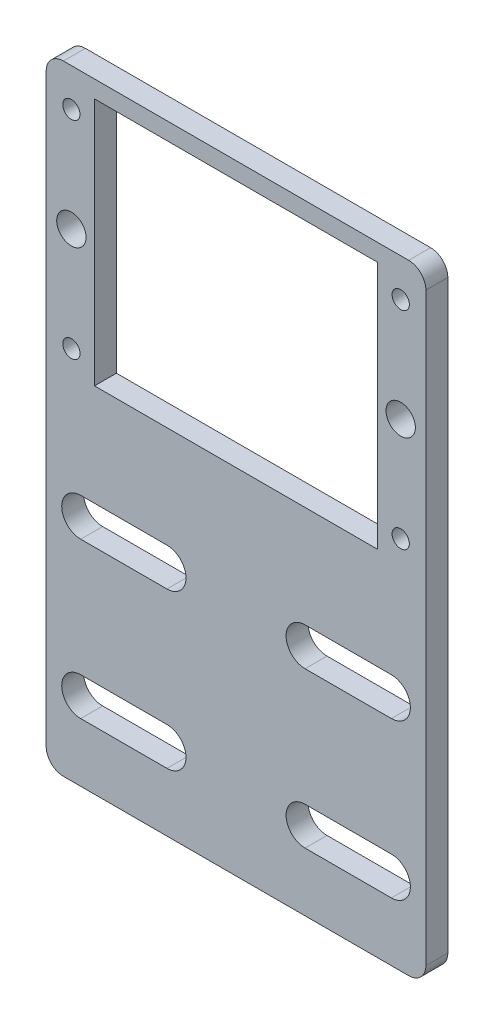
ISO-10303-21;
HEADER;
FILE_DESCRIPTION(('STEP AP214'),'2;1');
FILE_NAME('part.step','',(''),(''),'','','');
FILE_SCHEMA(('AUTOMOTIVE_DESIGN { 1 0 10303 214 1 1 1 1 }'));
ENDSEC;
DATA;
#1=APPLICATION_CONTEXT('core data for automotive mechanical design processes');
#2=APPLICATION_PROTOCOL_DEFINITION('international standard','automotive_design',2000,#1);
#3=PRODUCT_CONTEXT('',#1,'mechanical');
#4=PRODUCT('Part','Part','',(#3));
#5=PRODUCT_RELATED_PRODUCT_CATEGORY('part','',(#4));
#6=PRODUCT_DEFINITION_FORMATION('','',#4);
#7=PRODUCT_DEFINITION_CONTEXT('part definition',#1,'design');
#8=PRODUCT_DEFINITION('design','',#6,#7);
#9=PRODUCT_DEFINITION_SHAPE('','',#8);
#10=(LENGTH_UNIT() NAMED_UNIT(*) SI_UNIT(.MILLI.,.METRE.));
#11=(NAMED_UNIT(*) PLANE_ANGLE_UNIT() SI_UNIT($,.RADIAN.));
#12=(NAMED_UNIT(*) SI_UNIT($,.STERADIAN.) SOLID_ANGLE_UNIT());
#13=UNCERTAINTY_MEASURE_WITH_UNIT(LENGTH_MEASURE(1.E-05),#10,'distance_accuracy_value','');
#14=(GEOMETRIC_REPRESENTATION_CONTEXT(3) GLOBAL_UNCERTAINTY_ASSIGNED_CONTEXT((#13)) GLOBAL_UNIT_ASSIGNED_CONTEXT((#10,
#11,#12)) REPRESENTATION_CONTEXT('',''));
#15=CARTESIAN_POINT('',(0.,0.,0.));
#16=DIRECTION('',(0.,0.,1.));
#17=DIRECTION('',(1.,0.,0.));
#18=AXIS2_PLACEMENT_3D('',#15,#16,#17);
#19=CARTESIAN_POINT('',(0.,0.,6.35));
#20=DIRECTION('',(1.,0.,0.));
#21=DIRECTION('',(0.,0.,-1.));
#22=AXIS2_PLACEMENT_3D('',#19,#20,#21);
#23=PLANE('',#22);
#24=DIRECTION('',(0.,-1.,0.));
#25=VECTOR('',#24,1.);
#26=CARTESIAN_POINT('',(0.,0.,6.35));
#27=LINE('',#26,#25);
#28=CARTESIAN_POINT('',(0.,77.,6.35));
#29=VERTEX_POINT('',#28);
#30=CARTESIAN_POINT('',(0.,-92.464272110841,6.35));
#31=VERTEX_POINT('',#30);
#32=EDGE_CURVE('E397',#29,#31,#27,.T.);
#33=ORIENTED_EDGE('',*,*,#32,.F.);
#34=DIRECTION('',(0.,0.,-1.));
#35=VECTOR('',#34,1.);
#36=CARTESIAN_POINT('',(0.,77.,6.35));
#37=LINE('',#36,#35);
#38=CARTESIAN_POINT('',(0.,77.,0.));
#39=VERTEX_POINT('',#38);
#40=EDGE_CURVE('E439',#29,#39,#37,.T.);
#41=ORIENTED_EDGE('',*,*,#40,.T.);
#42=DIRECTION('',(0.,-1.,0.));
#43=VECTOR('',#42,1.);
#44=CARTESIAN_POINT('',(0.,0.,0.));
#45=LINE('',#44,#43);
#46=CARTESIAN_POINT('',(0.,-92.464272110841,0.));
#47=VERTEX_POINT('',#46);
#48=EDGE_CURVE('E396',#39,#47,#45,.T.);
#49=ORIENTED_EDGE('',*,*,#48,.T.);
#50=DIRECTION('',(0.,0.,1.));
#51=VECTOR('',#50,1.);
#52=CARTESIAN_POINT('',(0.,-92.464272110841,6.35));
#53=LINE('',#52,#51);
#54=EDGE_CURVE('E436',#47,#31,#53,.T.);
#55=ORIENTED_EDGE('',*,*,#54,.T.);
#56=EDGE_LOOP('',(#33,#41,#49,#55));
#57=FACE_BOUND('',#56,.T.);
#58=ADVANCED_FACE('F34',(#57),#23,.F.);
#59=CARTESIAN_POINT('',(110.,0.,6.35));
#60=DIRECTION('',(-1.,0.,0.));
#61=DIRECTION('',(0.,0.,1.));
#62=AXIS2_PLACEMENT_3D('',#59,#60,#61);
#63=PLANE('',#62);
#64=DIRECTION('',(0.,1.,0.));
#65=VECTOR('',#64,1.);
#66=CARTESIAN_POINT('',(110.,0.,0.));
#67=LINE('',#66,#65);
#68=CARTESIAN_POINT('',(110.,-92.464272110841,0.));
#69=VERTEX_POINT('',#68);
#70=CARTESIAN_POINT('',(110.,77.,0.));
#71=VERTEX_POINT('',#70);
#72=EDGE_CURVE('E409',#69,#71,#67,.T.);
#73=ORIENTED_EDGE('',*,*,#72,.T.);
#74=DIRECTION('',(0.,0.,-1.));
#75=VECTOR('',#74,1.);
#76=CARTESIAN_POINT('',(110.,77.,6.35));
#77=LINE('',#76,#75);
#78=CARTESIAN_POINT('',(110.,77.,6.35));
#79=VERTEX_POINT('',#78);
#80=EDGE_CURVE('E428',#71,#79,#77,.F.);
#81=ORIENTED_EDGE('',*,*,#80,.T.);
#82=DIRECTION('',(0.,1.,0.));
#83=VECTOR('',#82,1.);
#84=CARTESIAN_POINT('',(110.,0.,6.35));
#85=LINE('',#84,#83);
#86=CARTESIAN_POINT('',(110.,-92.464272110841,6.35));
#87=VERTEX_POINT('',#86);
#88=EDGE_CURVE('E399',#87,#79,#85,.T.);
#89=ORIENTED_EDGE('',*,*,#88,.F.);
#90=DIRECTION('',(0.,0.,1.));
#91=VECTOR('',#90,1.);
#92=CARTESIAN_POINT('',(110.,-92.464272110841,0.));
#93=LINE('',#92,#91);
#94=EDGE_CURVE('E426',#87,#69,#93,.F.);
#95=ORIENTED_EDGE('',*,*,#94,.T.);
#96=EDGE_LOOP('',(#73,#81,#89,#95));
#97=FACE_BOUND('',#96,.T.);
#98=ADVANCED_FACE('F450',(#97),#63,.F.);
#99=CARTESIAN_POINT('',(0.,82.,6.35));
#100=DIRECTION('',(0.,-1.,0.));
#101=DIRECTION('',(0.,0.,-1.));
#102=AXIS2_PLACEMENT_3D('',#99,#100,#101);
#103=PLANE('',#102);
#104=DIRECTION('',(-1.,0.,0.));
#105=VECTOR('',#104,1.);
#106=CARTESIAN_POINT('',(0.,82.,6.35));
#107=LINE('',#106,#105);
#108=CARTESIAN_POINT('',(105.,82.,6.35));
#109=VERTEX_POINT('',#108);
#110=CARTESIAN_POINT('',(5.,82.,6.35));
#111=VERTEX_POINT('',#110);
#112=EDGE_CURVE('E403',#109,#111,#107,.T.);
#113=ORIENTED_EDGE('',*,*,#112,.F.);
#114=DIRECTION('',(0.,0.,-1.));
#115=VECTOR('',#114,1.);
#116=CARTESIAN_POINT('',(105.,82.,6.35));
#117=LINE('',#116,#115);
#118=CARTESIAN_POINT('',(105.,82.,0.));
#119=VERTEX_POINT('',#118);
#120=EDGE_CURVE('E415',#109,#119,#117,.T.);
#121=ORIENTED_EDGE('',*,*,#120,.T.);
#122=DIRECTION('',(-1.,0.,0.));
#123=VECTOR('',#122,1.);
#124=CARTESIAN_POINT('',(0.,82.,0.));
#125=LINE('',#124,#123);
#126=CARTESIAN_POINT('',(5.,82.,0.));
#127=VERTEX_POINT('',#126);
#128=EDGE_CURVE('E400',#119,#127,#125,.T.);
#129=ORIENTED_EDGE('',*,*,#128,.T.);
#130=DIRECTION('',(0.,0.,-1.));
#131=VECTOR('',#130,1.);
#132=CARTESIAN_POINT('',(5.,82.,6.35));
#133=LINE('',#132,#131);
#134=EDGE_CURVE('E406',#127,#111,#133,.F.);
#135=ORIENTED_EDGE('',*,*,#134,.T.);
#136=EDGE_LOOP('',(#113,#121,#129,#135));
#137=FACE_BOUND('',#136,.T.);
#138=ADVANCED_FACE('F462',(#137),#103,.F.);
#139=CARTESIAN_POINT('',(0.,0.,6.35));
#140=DIRECTION('',(0.,0.,-1.));
#141=DIRECTION('',(-1.,0.,0.));
#142=AXIS2_PLACEMENT_3D('',#139,#140,#141);
#143=PLANE('',#142);
#144=CARTESIAN_POINT('',(7.29880000000002,70.9974,6.35));
#145=DIRECTION('',(0.,0.,1.));
#146=DIRECTION('',(-1.,0.,0.));
#147=AXIS2_PLACEMENT_3D('',#144,#145,#146);
#148=CIRCLE('',#147,2.5019);
#149=CARTESIAN_POINT('',(4.79690000000002,70.9974,6.35));
#150=VERTEX_POINT('',#149);
#151=EDGE_CURVE('E796',#150,#150,#148,.T.);
#152=ORIENTED_EDGE('',*,*,#151,.F.);
#153=EDGE_LOOP('',(#152));
#154=FACE_BOUND('',#153,.T.);
#155=CARTESIAN_POINT('',(102.7012,70.9974,6.35));
#156=DIRECTION('',(0.,0.,1.));
#157=DIRECTION('',(1.,0.,0.));
#158=AXIS2_PLACEMENT_3D('',#155,#156,#157);
#159=CIRCLE('',#158,2.50189999999999);
#160=CARTESIAN_POINT('',(105.2031,70.9974,6.35));
#161=VERTEX_POINT('',#160);
#162=EDGE_CURVE('E801',#161,#161,#159,.T.);
#163=ORIENTED_EDGE('',*,*,#162,.F.);
#164=EDGE_LOOP('',(#163));
#165=FACE_BOUND('',#164,.T.);
#166=CARTESIAN_POINT('',(102.7012,11.0026,6.35));
#167=DIRECTION('',(0.,0.,1.));
#168=DIRECTION('',(-1.,0.,0.));
#169=AXIS2_PLACEMENT_3D('',#166,#167,#168);
#170=CIRCLE('',#169,2.50190000000001);
#171=CARTESIAN_POINT('',(100.1993,11.0026,6.35));
#172=VERTEX_POINT('',#171);
#173=EDGE_CURVE('E812',#172,#172,#170,.T.);
#174=ORIENTED_EDGE('',*,*,#173,.F.);
#175=EDGE_LOOP('',(#174));
#176=FACE_BOUND('',#175,.T.);
#177=CARTESIAN_POINT('',(7.29880000000002,41.,6.35));
#178=DIRECTION('',(0.,0.,1.));
#179=DIRECTION('',(1.,0.,0.));
#180=AXIS2_PLACEMENT_3D('',#177,#178,#179);
#181=CIRCLE('',#180,4.25);
#182=CARTESIAN_POINT('',(11.5488,41.,6.35));
#183=VERTEX_POINT('',#182);
#184=EDGE_CURVE('E818',#183,#183,#181,.T.);
#185=ORIENTED_EDGE('',*,*,#184,.F.);
#186=EDGE_LOOP('',(#185));
#187=FACE_BOUND('',#186,.T.);
#188=CARTESIAN_POINT('',(102.7012,41.,6.35));
#189=DIRECTION('',(0.,0.,1.));
#190=DIRECTION('',(-1.,0.,0.));
#191=AXIS2_PLACEMENT_3D('',#188,#189,#190);
#192=CIRCLE('',#191,4.24999999999999);
#193=CARTESIAN_POINT('',(98.4512,41.,6.35));
#194=VERTEX_POINT('',#193);
#195=EDGE_CURVE('E824',#194,#194,#192,.T.);
#196=ORIENTED_EDGE('',*,*,#195,.F.);
#197=EDGE_LOOP('',(#196));
#198=FACE_BOUND('',#197,.T.);
#199=CARTESIAN_POINT('',(7.29880000000002,11.0026,6.35));
#200=DIRECTION('',(0.,0.,1.));
#201=DIRECTION('',(1.,0.,0.));
#202=AXIS2_PLACEMENT_3D('',#199,#200,#201);
#203=CIRCLE('',#202,2.5019);
#204=CARTESIAN_POINT('',(9.80070000000002,11.0026,6.35));
#205=VERTEX_POINT('',#204);
#206=EDGE_CURVE('E300',#205,#205,#203,.T.);
#207=ORIENTED_EDGE('',*,*,#206,.F.);
#208=EDGE_LOOP('',(#207));
#209=FACE_BOUND('',#208,.T.);
#210=DIRECTION('',(1.,0.,0.));
#211=VECTOR('',#210,1.);
#212=CARTESIAN_POINT('',(10.,-35.464272110841,6.35));
#213=LINE('',#212,#211);
#214=CARTESIAN_POINT('',(10.,-35.464272110841,6.35));
#215=VERTEX_POINT('',#214);
#216=CARTESIAN_POINT('',(35.,-35.464272110841,6.35));
#217=VERTEX_POINT('',#216);
#218=EDGE_CURVE('E308',#215,#217,#213,.T.);
#219=ORIENTED_EDGE('',*,*,#218,.F.);
#220=CARTESIAN_POINT('',(10.,-29.964272110841,6.35));
#221=DIRECTION('',(0.,0.,1.));
#222=DIRECTION('',(-1.,0.,0.));
#223=AXIS2_PLACEMENT_3D('',#220,#221,#222);
#224=CIRCLE('',#223,5.5);
#225=CARTESIAN_POINT('',(10.,-24.464272110841,6.35));
#226=VERTEX_POINT('',#225);
#227=EDGE_CURVE('E306',#226,#215,#224,.T.);
#228=ORIENTED_EDGE('',*,*,#227,.F.);
#229=DIRECTION('',(-1.,0.,0.));
#230=VECTOR('',#229,1.);
#231=CARTESIAN_POINT('',(10.,-24.464272110841,6.35));
#232=LINE('',#231,#230);
#233=CARTESIAN_POINT('',(35.,-24.464272110841,6.35));
#234=VERTEX_POINT('',#233);
#235=EDGE_CURVE('E314',#234,#226,#232,.T.);
#236=ORIENTED_EDGE('',*,*,#235,.F.);
#237=CARTESIAN_POINT('',(35.,-29.964272110841,6.35));
#238=DIRECTION('',(0.,0.,1.));
#239=DIRECTION('',(-1.,0.,0.));
#240=AXIS2_PLACEMENT_3D('',#237,#238,#239);
#241=CIRCLE('',#240,5.50000000000001);
#242=EDGE_CURVE('E311',#217,#234,#241,.T.);
#243=ORIENTED_EDGE('',*,*,#242,.F.);
#244=EDGE_LOOP('',(#219,#228,#236,#243));
#245=FACE_BOUND('',#244,.T.);
#246=DIRECTION('',(-1.,0.,0.));
#247=VECTOR('',#246,1.);
#248=CARTESIAN_POINT('',(100.,-24.464272110841,6.35));
#249=LINE('',#248,#247);
#250=CARTESIAN_POINT('',(100.,-24.464272110841,6.35));
#251=VERTEX_POINT('',#250);
#252=CARTESIAN_POINT('',(75.,-24.464272110841,6.35));
#253=VERTEX_POINT('',#252);
#254=EDGE_CURVE('E275',#251,#253,#249,.T.);
#255=ORIENTED_EDGE('',*,*,#254,.F.);
#256=CARTESIAN_POINT('',(100.,-29.964272110841,6.35));
#257=DIRECTION('',(0.,0.,1.));
#258=DIRECTION('',(1.,0.,0.));
#259=AXIS2_PLACEMENT_3D('',#256,#257,#258);
#260=CIRCLE('',#259,5.5);
#261=CARTESIAN_POINT('',(100.,-35.464272110841,6.35));
#262=VERTEX_POINT('',#261);
#263=EDGE_CURVE('E273',#262,#251,#260,.T.);
#264=ORIENTED_EDGE('',*,*,#263,.F.);
#265=DIRECTION('',(1.,0.,0.));
#266=VECTOR('',#265,1.);
#267=CARTESIAN_POINT('',(100.,-35.464272110841,6.35));
#268=LINE('',#267,#266);
#269=CARTESIAN_POINT('',(75.,-35.464272110841,6.35));
#270=VERTEX_POINT('',#269);
#271=EDGE_CURVE('E281',#270,#262,#268,.T.);
#272=ORIENTED_EDGE('',*,*,#271,.F.);
#273=CARTESIAN_POINT('',(75.,-29.964272110841,6.35));
#274=DIRECTION('',(0.,0.,1.));
#275=DIRECTION('',(1.,0.,0.));
#276=AXIS2_PLACEMENT_3D('',#273,#274,#275);
#277=CIRCLE('',#276,5.50000000000001);
#278=EDGE_CURVE('E278',#253,#270,#277,.T.);
#279=ORIENTED_EDGE('',*,*,#278,.F.);
#280=EDGE_LOOP('',(#255,#264,#272,#279));
#281=FACE_BOUND('',#280,.T.);
#282=DIRECTION('',(-1.,0.,0.));
#283=VECTOR('',#282,1.);
#284=CARTESIAN_POINT('',(100.,-69.464272110841,6.35));
#285=LINE('',#284,#283);
#286=CARTESIAN_POINT('',(100.,-69.464272110841,6.35));
#287=VERTEX_POINT('',#286);
#288=CARTESIAN_POINT('',(75.,-69.464272110841,6.35));
#289=VERTEX_POINT('',#288);
#290=EDGE_CURVE('E247',#287,#289,#285,.T.);
#291=ORIENTED_EDGE('',*,*,#290,.F.);
#292=CARTESIAN_POINT('',(100.,-74.964272110841,6.35));
#293=DIRECTION('',(0.,0.,1.));
#294=DIRECTION('',(-1.,0.,0.));
#295=AXIS2_PLACEMENT_3D('',#292,#293,#294);
#296=CIRCLE('',#295,5.50000000000001);
#297=CARTESIAN_POINT('',(100.,-80.464272110841,6.35));
#298=VERTEX_POINT('',#297);
#299=EDGE_CURVE('E239',#298,#287,#296,.T.);
#300=ORIENTED_EDGE('',*,*,#299,.F.);
#301=DIRECTION('',(1.,0.,0.));
#302=VECTOR('',#301,1.);
#303=CARTESIAN_POINT('',(100.,-80.464272110841,6.35));
#304=LINE('',#303,#302);
#305=CARTESIAN_POINT('',(75.,-80.464272110841,6.35));
#306=VERTEX_POINT('',#305);
#307=EDGE_CURVE('E240',#306,#298,#304,.T.);
#308=ORIENTED_EDGE('',*,*,#307,.F.);
#309=CARTESIAN_POINT('',(75.,-74.964272110841,6.35));
#310=DIRECTION('',(0.,0.,1.));
#311=DIRECTION('',(-1.,0.,0.));
#312=AXIS2_PLACEMENT_3D('',#309,#310,#311);
#313=CIRCLE('',#312,5.50000000000001);
#314=EDGE_CURVE('E254',#289,#306,#313,.T.);
#315=ORIENTED_EDGE('',*,*,#314,.F.);
#316=EDGE_LOOP('',(#291,#300,#308,#315));
#317=FACE_BOUND('',#316,.T.);
#318=DIRECTION('',(1.,0.,0.));
#319=VECTOR('',#318,1.);
#320=CARTESIAN_POINT('',(10.,-80.464272110841,6.35));
#321=LINE('',#320,#319);
#322=CARTESIAN_POINT('',(10.,-80.464272110841,6.35));
#323=VERTEX_POINT('',#322);
#324=CARTESIAN_POINT('',(35.,-80.464272110841,6.35));
#325=VERTEX_POINT('',#324);
#326=EDGE_CURVE('E338',#323,#325,#321,.T.);
#327=ORIENTED_EDGE('',*,*,#326,.F.);
#328=CARTESIAN_POINT('',(10.,-74.964272110841,6.35));
#329=DIRECTION('',(0.,0.,1.));
#330=DIRECTION('',(1.,0.,0.));
#331=AXIS2_PLACEMENT_3D('',#328,#329,#330);
#332=CIRCLE('',#331,5.50000000000001);
#333=CARTESIAN_POINT('',(10.,-69.464272110841,6.35));
#334=VERTEX_POINT('',#333);
#335=EDGE_CURVE('E336',#334,#323,#332,.T.);
#336=ORIENTED_EDGE('',*,*,#335,.F.);
#337=DIRECTION('',(-1.,0.,0.));
#338=VECTOR('',#337,1.);
#339=CARTESIAN_POINT('',(10.,-69.464272110841,6.35));
#340=LINE('',#339,#338);
#341=CARTESIAN_POINT('',(35.,-69.464272110841,6.35));
#342=VERTEX_POINT('',#341);
#343=EDGE_CURVE('E344',#342,#334,#340,.T.);
#344=ORIENTED_EDGE('',*,*,#343,.F.);
#345=CARTESIAN_POINT('',(35.,-74.964272110841,6.35));
#346=DIRECTION('',(0.,0.,1.));
#347=DIRECTION('',(1.,0.,0.));
#348=AXIS2_PLACEMENT_3D('',#345,#346,#347);
#349=CIRCLE('',#348,5.50000000000001);
#350=EDGE_CURVE('E341',#325,#342,#349,.T.);
#351=ORIENTED_EDGE('',*,*,#350,.F.);
#352=EDGE_LOOP('',(#327,#336,#344,#351));
#353=FACE_BOUND('',#352,.T.);
#354=DIRECTION('',(-1.,0.,0.));
#355=VECTOR('',#354,1.);
#356=CARTESIAN_POINT('',(14.,77.,6.35));
#357=LINE('',#356,#355);
#358=CARTESIAN_POINT('',(96.,77.,6.35));
#359=VERTEX_POINT('',#358);
#360=CARTESIAN_POINT('',(14.,77.,6.35));
#361=VERTEX_POINT('',#360);
#362=EDGE_CURVE('E375',#359,#361,#357,.T.);
#363=ORIENTED_EDGE('',*,*,#362,.F.);
#364=DIRECTION('',(0.,1.,0.));
#365=VECTOR('',#364,1.);
#366=CARTESIAN_POINT('',(96.,5.,6.35));
#367=LINE('',#366,#365);
#368=CARTESIAN_POINT('',(96.,5.,6.35));
#369=VERTEX_POINT('',#368);
#370=EDGE_CURVE('E373',#369,#359,#367,.T.);
#371=ORIENTED_EDGE('',*,*,#370,.F.);
#372=DIRECTION('',(1.,0.,0.));
#373=VECTOR('',#372,1.);
#374=CARTESIAN_POINT('',(14.,5.,6.35));
#375=LINE('',#374,#373);
#376=CARTESIAN_POINT('',(14.,5.,6.35));
#377=VERTEX_POINT('',#376);
#378=EDGE_CURVE('E381',#377,#369,#375,.T.);
#379=ORIENTED_EDGE('',*,*,#378,.F.);
#380=DIRECTION('',(0.,-1.,0.));
#381=VECTOR('',#380,1.);
#382=CARTESIAN_POINT('',(14.,5.,6.35));
#383=LINE('',#382,#381);
#384=EDGE_CURVE('E378',#361,#377,#383,.T.);
#385=ORIENTED_EDGE('',*,*,#384,.F.);
#386=EDGE_LOOP('',(#363,#371,#379,#385));
#387=FACE_BOUND('',#386,.T.);
#388=ORIENTED_EDGE('',*,*,#88,.T.);
#389=CARTESIAN_POINT('',(105.,77.,6.35));
#390=DIRECTION('',(0.,0.,-1.));
#391=DIRECTION('',(-1.,0.,0.));
#392=AXIS2_PLACEMENT_3D('',#389,#390,#391);
#393=CIRCLE('',#392,5.);
#394=EDGE_CURVE('E434',#79,#109,#393,.F.);
#395=ORIENTED_EDGE('',*,*,#394,.T.);
#396=ORIENTED_EDGE('',*,*,#112,.T.);
#397=CARTESIAN_POINT('',(5.,77.,6.35));
#398=DIRECTION('',(0.,0.,-1.));
#399=DIRECTION('',(-1.,0.,0.));
#400=AXIS2_PLACEMENT_3D('',#397,#398,#399);
#401=CIRCLE('',#400,5.);
#402=EDGE_CURVE('E432',#111,#29,#401,.F.);
#403=ORIENTED_EDGE('',*,*,#402,.T.);
#404=ORIENTED_EDGE('',*,*,#32,.T.);
#405=CARTESIAN_POINT('',(5.,-92.464272110841,6.35));
#406=DIRECTION('',(0.,0.,-1.));
#407=DIRECTION('',(-1.,0.,0.));
#408=AXIS2_PLACEMENT_3D('',#405,#406,#407);
#409=CIRCLE('',#408,5.);
#410=CARTESIAN_POINT('',(5.,-97.464272110841,6.35));
#411=VERTEX_POINT('',#410);
#412=EDGE_CURVE('E57',#31,#411,#409,.F.);
#413=ORIENTED_EDGE('',*,*,#412,.T.);
#414=DIRECTION('',(1.,0.,0.));
#415=VECTOR('',#414,1.);
#416=CARTESIAN_POINT('',(0.,-97.464272110841,6.35));
#417=LINE('',#416,#415);
#418=CARTESIAN_POINT('',(105.,-97.464272110841,6.35));
#419=VERTEX_POINT('',#418);
#420=EDGE_CURVE('E359',#411,#419,#417,.T.);
#421=ORIENTED_EDGE('',*,*,#420,.T.);
#422=CARTESIAN_POINT('',(105.,-92.464272110841,6.34999999999999));
#423=DIRECTION('',(0.,0.,-1.));
#424=DIRECTION('',(-1.,0.,0.));
#425=AXIS2_PLACEMENT_3D('',#422,#423,#424);
#426=CIRCLE('',#425,5.);
#427=EDGE_CURVE('E49',#419,#87,#426,.F.);
#428=ORIENTED_EDGE('',*,*,#427,.T.);
#429=EDGE_LOOP('',(#388,#395,#396,#403,#404,#413,#421,#428));
#430=FACE_BOUND('',#429,.T.);
#431=ADVANCED_FACE('F446',(#154,#165,#176,#187,#198,#209,#245,#281,#317,#353,#387,#430),#143,.F.);
#432=CARTESIAN_POINT('',(0.,0.,0.));
#433=DIRECTION('',(0.,0.,-1.));
#434=DIRECTION('',(-1.,0.,0.));
#435=AXIS2_PLACEMENT_3D('',#432,#433,#434);
#436=PLANE('',#435);
#437=CARTESIAN_POINT('',(7.29880000000002,70.9974,0.));
#438=DIRECTION('',(0.,0.,-1.));
#439=DIRECTION('',(-1.,0.,0.));
#440=AXIS2_PLACEMENT_3D('',#437,#438,#439);
#441=CIRCLE('',#440,2.5019);
#442=CARTESIAN_POINT('',(4.79690000000002,70.9974,0.));
#443=VERTEX_POINT('',#442);
#444=EDGE_CURVE('E793',#443,#443,#441,.F.);
#445=ORIENTED_EDGE('',*,*,#444,.T.);
#446=EDGE_LOOP('',(#445));
#447=FACE_BOUND('',#446,.T.);
#448=CARTESIAN_POINT('',(102.7012,70.9974,0.));
#449=DIRECTION('',(0.,0.,-1.));
#450=DIRECTION('',(-1.,0.,0.));
#451=AXIS2_PLACEMENT_3D('',#448,#449,#450);
#452=CIRCLE('',#451,2.50189999999999);
#453=CARTESIAN_POINT('',(100.1993,70.9974,0.));
#454=VERTEX_POINT('',#453);
#455=EDGE_CURVE('E809',#454,#454,#452,.F.);
#456=ORIENTED_EDGE('',*,*,#455,.T.);
#457=EDGE_LOOP('',(#456));
#458=FACE_BOUND('',#457,.T.);
#459=CARTESIAN_POINT('',(102.7012,11.0026,0.));
#460=DIRECTION('',(0.,0.,-1.));
#461=DIRECTION('',(-1.,0.,0.));
#462=AXIS2_PLACEMENT_3D('',#459,#460,#461);
#463=CIRCLE('',#462,2.50190000000001);
#464=CARTESIAN_POINT('',(100.1993,11.0026,0.));
#465=VERTEX_POINT('',#464);
#466=EDGE_CURVE('E815',#465,#465,#463,.F.);
#467=ORIENTED_EDGE('',*,*,#466,.T.);
#468=EDGE_LOOP('',(#467));
#469=FACE_BOUND('',#468,.T.);
#470=CARTESIAN_POINT('',(7.29880000000002,41.,0.));
#471=DIRECTION('',(0.,0.,-1.));
#472=DIRECTION('',(-1.,0.,0.));
#473=AXIS2_PLACEMENT_3D('',#470,#471,#472);
#474=CIRCLE('',#473,4.25);
#475=CARTESIAN_POINT('',(3.04880000000002,41.,0.));
#476=VERTEX_POINT('',#475);
#477=EDGE_CURVE('E821',#476,#476,#474,.F.);
#478=ORIENTED_EDGE('',*,*,#477,.T.);
#479=EDGE_LOOP('',(#478));
#480=FACE_BOUND('',#479,.T.);
#481=CARTESIAN_POINT('',(102.7012,41.,0.));
#482=DIRECTION('',(0.,0.,-1.));
#483=DIRECTION('',(-1.,0.,0.));
#484=AXIS2_PLACEMENT_3D('',#481,#482,#483);
#485=CIRCLE('',#484,4.24999999999999);
#486=CARTESIAN_POINT('',(98.4512,41.,0.));
#487=VERTEX_POINT('',#486);
#488=EDGE_CURVE('E804',#487,#487,#485,.F.);
#489=ORIENTED_EDGE('',*,*,#488,.T.);
#490=EDGE_LOOP('',(#489));
#491=FACE_BOUND('',#490,.T.);
#492=CARTESIAN_POINT('',(7.29880000000002,11.0026,0.));
#493=DIRECTION('',(0.,0.,-1.));
#494=DIRECTION('',(-1.,0.,0.));
#495=AXIS2_PLACEMENT_3D('',#492,#493,#494);
#496=CIRCLE('',#495,2.5019);
#497=CARTESIAN_POINT('',(4.79690000000002,11.0026,0.));
#498=VERTEX_POINT('',#497);
#499=EDGE_CURVE('E797',#498,#498,#496,.F.);
#500=ORIENTED_EDGE('',*,*,#499,.T.);
#501=EDGE_LOOP('',(#500));
#502=FACE_BOUND('',#501,.T.);
#503=CARTESIAN_POINT('',(10.,-29.964272110841,0.));
#504=DIRECTION('',(0.,0.,-1.));
#505=DIRECTION('',(-1.,0.,0.));
#506=AXIS2_PLACEMENT_3D('',#503,#504,#505);
#507=CIRCLE('',#506,5.5);
#508=CARTESIAN_POINT('',(10.,-24.464272110841,0.));
#509=VERTEX_POINT('',#508);
#510=CARTESIAN_POINT('',(10.,-35.464272110841,0.));
#511=VERTEX_POINT('',#510);
#512=EDGE_CURVE('E303',#509,#511,#507,.F.);
#513=ORIENTED_EDGE('',*,*,#512,.T.);
#514=DIRECTION('',(1.,0.,0.));
#515=VECTOR('',#514,1.);
#516=CARTESIAN_POINT('',(10.,-35.464272110841,0.));
#517=LINE('',#516,#515);
#518=CARTESIAN_POINT('',(35.,-35.464272110841,0.));
#519=VERTEX_POINT('',#518);
#520=EDGE_CURVE('E267',#511,#519,#517,.T.);
#521=ORIENTED_EDGE('',*,*,#520,.T.);
#522=CARTESIAN_POINT('',(35.,-29.964272110841,0.));
#523=DIRECTION('',(0.,0.,-1.));
#524=DIRECTION('',(-1.,0.,0.));
#525=AXIS2_PLACEMENT_3D('',#522,#523,#524);
#526=CIRCLE('',#525,5.50000000000001);
#527=CARTESIAN_POINT('',(35.,-24.464272110841,0.));
#528=VERTEX_POINT('',#527);
#529=EDGE_CURVE('E296',#519,#528,#526,.F.);
#530=ORIENTED_EDGE('',*,*,#529,.T.);
#531=DIRECTION('',(-1.,0.,0.));
#532=VECTOR('',#531,1.);
#533=CARTESIAN_POINT('',(10.,-24.464272110841,0.));
#534=LINE('',#533,#532);
#535=EDGE_CURVE('E299',#528,#509,#534,.T.);
#536=ORIENTED_EDGE('',*,*,#535,.T.);
#537=EDGE_LOOP('',(#513,#521,#530,#536));
#538=FACE_BOUND('',#537,.T.);
#539=CARTESIAN_POINT('',(100.,-29.964272110841,0.));
#540=DIRECTION('',(0.,0.,-1.));
#541=DIRECTION('',(-1.,0.,0.));
#542=AXIS2_PLACEMENT_3D('',#539,#540,#541);
#543=CIRCLE('',#542,5.5);
#544=CARTESIAN_POINT('',(100.,-35.464272110841,0.));
#545=VERTEX_POINT('',#544);
#546=CARTESIAN_POINT('',(100.,-24.464272110841,0.));
#547=VERTEX_POINT('',#546);
#548=EDGE_CURVE('E270',#545,#547,#543,.F.);
#549=ORIENTED_EDGE('',*,*,#548,.T.);
#550=DIRECTION('',(-1.,0.,0.));
#551=VECTOR('',#550,1.);
#552=CARTESIAN_POINT('',(100.,-24.464272110841,0.));
#553=LINE('',#552,#551);
#554=CARTESIAN_POINT('',(75.,-24.464272110841,0.));
#555=VERTEX_POINT('',#554);
#556=EDGE_CURVE('E287',#547,#555,#553,.T.);
#557=ORIENTED_EDGE('',*,*,#556,.T.);
#558=CARTESIAN_POINT('',(75.,-29.964272110841,0.));
#559=DIRECTION('',(0.,0.,-1.));
#560=DIRECTION('',(-1.,0.,0.));
#561=AXIS2_PLACEMENT_3D('',#558,#559,#560);
#562=CIRCLE('',#561,5.50000000000001);
#563=CARTESIAN_POINT('',(75.,-35.464272110841,0.));
#564=VERTEX_POINT('',#563);
#565=EDGE_CURVE('E263',#555,#564,#562,.F.);
#566=ORIENTED_EDGE('',*,*,#565,.T.);
#567=DIRECTION('',(1.,0.,0.));
#568=VECTOR('',#567,1.);
#569=CARTESIAN_POINT('',(100.,-35.464272110841,0.));
#570=LINE('',#569,#568);
#571=EDGE_CURVE('E266',#564,#545,#570,.T.);
#572=ORIENTED_EDGE('',*,*,#571,.T.);
#573=EDGE_LOOP('',(#549,#557,#566,#572));
#574=FACE_BOUND('',#573,.T.);
#575=CARTESIAN_POINT('',(100.,-74.964272110841,0.));
#576=DIRECTION('',(0.,0.,-1.));
#577=DIRECTION('',(-1.,0.,0.));
#578=AXIS2_PLACEMENT_3D('',#575,#576,#577);
#579=CIRCLE('',#578,5.50000000000001);
#580=CARTESIAN_POINT('',(100.,-80.464272110841,0.));
#581=VERTEX_POINT('',#580);
#582=CARTESIAN_POINT('',(100.,-69.464272110841,0.));
#583=VERTEX_POINT('',#582);
#584=EDGE_CURVE('E236',#581,#583,#579,.F.);
#585=ORIENTED_EDGE('',*,*,#584,.T.);
#586=DIRECTION('',(-1.,0.,0.));
#587=VECTOR('',#586,1.);
#588=CARTESIAN_POINT('',(100.,-69.464272110841,0.));
#589=LINE('',#588,#587);
#590=CARTESIAN_POINT('',(75.,-69.464272110841,0.));
#591=VERTEX_POINT('',#590);
#592=EDGE_CURVE('E220',#583,#591,#589,.T.);
#593=ORIENTED_EDGE('',*,*,#592,.T.);
#594=CARTESIAN_POINT('',(75.,-74.964272110841,0.));
#595=DIRECTION('',(0.,0.,-1.));
#596=DIRECTION('',(-1.,0.,0.));
#597=AXIS2_PLACEMENT_3D('',#594,#595,#596);
#598=CIRCLE('',#597,5.50000000000001);
#599=CARTESIAN_POINT('',(75.,-80.464272110841,0.));
#600=VERTEX_POINT('',#599);
#601=EDGE_CURVE('E249',#591,#600,#598,.F.);
#602=ORIENTED_EDGE('',*,*,#601,.T.);
#603=DIRECTION('',(1.,0.,0.));
#604=VECTOR('',#603,1.);
#605=CARTESIAN_POINT('',(100.,-80.464272110841,0.));
#606=LINE('',#605,#604);
#607=EDGE_CURVE('E245',#600,#581,#606,.T.);
#608=ORIENTED_EDGE('',*,*,#607,.T.);
#609=EDGE_LOOP('',(#585,#593,#602,#608));
#610=FACE_BOUND('',#609,.T.);
#611=CARTESIAN_POINT('',(10.,-74.964272110841,0.));
#612=DIRECTION('',(0.,0.,-1.));
#613=DIRECTION('',(-1.,0.,0.));
#614=AXIS2_PLACEMENT_3D('',#611,#612,#613);
#615=CIRCLE('',#614,5.50000000000001);
#616=CARTESIAN_POINT('',(10.,-69.464272110841,0.));
#617=VERTEX_POINT('',#616);
#618=CARTESIAN_POINT('',(10.,-80.464272110841,0.));
#619=VERTEX_POINT('',#618);
#620=EDGE_CURVE('E333',#617,#619,#615,.F.);
#621=ORIENTED_EDGE('',*,*,#620,.T.);
#622=DIRECTION('',(1.,0.,0.));
#623=VECTOR('',#622,1.);
#624=CARTESIAN_POINT('',(10.,-80.464272110841,0.));
#625=LINE('',#624,#623);
#626=CARTESIAN_POINT('',(35.,-80.464272110841,0.));
#627=VERTEX_POINT('',#626);
#628=EDGE_CURVE('E350',#619,#627,#625,.T.);
#629=ORIENTED_EDGE('',*,*,#628,.T.);
#630=CARTESIAN_POINT('',(35.,-74.964272110841,0.));
#631=DIRECTION('',(0.,0.,-1.));
#632=DIRECTION('',(-1.,0.,0.));
#633=AXIS2_PLACEMENT_3D('',#630,#631,#632);
#634=CIRCLE('',#633,5.50000000000001);
#635=CARTESIAN_POINT('',(35.,-69.464272110841,0.));
#636=VERTEX_POINT('',#635);
#637=EDGE_CURVE('E231',#627,#636,#634,.F.);
#638=ORIENTED_EDGE('',*,*,#637,.T.);
#639=DIRECTION('',(-1.,0.,0.));
#640=VECTOR('',#639,1.);
#641=CARTESIAN_POINT('',(10.,-69.464272110841,0.));
#642=LINE('',#641,#640);
#643=EDGE_CURVE('E330',#636,#617,#642,.T.);
#644=ORIENTED_EDGE('',*,*,#643,.T.);
#645=EDGE_LOOP('',(#621,#629,#638,#644));
#646=FACE_BOUND('',#645,.T.);
#647=DIRECTION('',(0.,1.,0.));
#648=VECTOR('',#647,1.);
#649=CARTESIAN_POINT('',(96.,5.,0.));
#650=LINE('',#649,#648);
#651=CARTESIAN_POINT('',(96.,5.,0.));
#652=VERTEX_POINT('',#651);
#653=CARTESIAN_POINT('',(96.,77.,0.));
#654=VERTEX_POINT('',#653);
#655=EDGE_CURVE('E370',#652,#654,#650,.T.);
#656=ORIENTED_EDGE('',*,*,#655,.T.);
#657=DIRECTION('',(-1.,0.,0.));
#658=VECTOR('',#657,1.);
#659=CARTESIAN_POINT('',(14.,77.,0.));
#660=LINE('',#659,#658);
#661=CARTESIAN_POINT('',(14.,77.,0.));
#662=VERTEX_POINT('',#661);
#663=EDGE_CURVE('E387',#654,#662,#660,.T.);
#664=ORIENTED_EDGE('',*,*,#663,.T.);
#665=DIRECTION('',(0.,-1.,0.));
#666=VECTOR('',#665,1.);
#667=CARTESIAN_POINT('',(14.,5.,0.));
#668=LINE('',#667,#666);
#669=CARTESIAN_POINT('',(14.,5.,0.));
#670=VERTEX_POINT('',#669);
#671=EDGE_CURVE('E364',#662,#670,#668,.T.);
#672=ORIENTED_EDGE('',*,*,#671,.T.);
#673=DIRECTION('',(1.,0.,0.));
#674=VECTOR('',#673,1.);
#675=CARTESIAN_POINT('',(14.,5.,0.));
#676=LINE('',#675,#674);
#677=EDGE_CURVE('E367',#670,#652,#676,.T.);
#678=ORIENTED_EDGE('',*,*,#677,.T.);
#679=EDGE_LOOP('',(#656,#664,#672,#678));
#680=FACE_BOUND('',#679,.T.);
#681=ORIENTED_EDGE('',*,*,#128,.F.);
#682=CARTESIAN_POINT('',(105.,77.,0.));
#683=DIRECTION('',(0.,0.,-1.));
#684=DIRECTION('',(-1.,0.,0.));
#685=AXIS2_PLACEMENT_3D('',#682,#683,#684);
#686=CIRCLE('',#685,5.);
#687=EDGE_CURVE('E424',#119,#71,#686,.T.);
#688=ORIENTED_EDGE('',*,*,#687,.T.);
#689=ORIENTED_EDGE('',*,*,#72,.F.);
#690=CARTESIAN_POINT('',(105.,-92.464272110841,0.));
#691=DIRECTION('',(0.,0.,-1.));
#692=DIRECTION('',(-1.,0.,0.));
#693=AXIS2_PLACEMENT_3D('',#690,#691,#692);
#694=CIRCLE('',#693,5.);
#695=CARTESIAN_POINT('',(105.,-97.464272110841,0.));
#696=VERTEX_POINT('',#695);
#697=EDGE_CURVE('E418',#69,#696,#694,.T.);
#698=ORIENTED_EDGE('',*,*,#697,.T.);
#699=DIRECTION('',(1.,0.,0.));
#700=VECTOR('',#699,1.);
#701=CARTESIAN_POINT('',(0.,-97.464272110841,0.));
#702=LINE('',#701,#700);
#703=CARTESIAN_POINT('',(5.,-97.464272110841,0.));
#704=VERTEX_POINT('',#703);
#705=EDGE_CURVE('E361',#704,#696,#702,.T.);
#706=ORIENTED_EDGE('',*,*,#705,.F.);
#707=CARTESIAN_POINT('',(5.,-92.464272110841,0.));
#708=DIRECTION('',(0.,0.,-1.));
#709=DIRECTION('',(-1.,0.,0.));
#710=AXIS2_PLACEMENT_3D('',#707,#708,#709);
#711=CIRCLE('',#710,5.);
#712=EDGE_CURVE('E420',#704,#47,#711,.T.);
#713=ORIENTED_EDGE('',*,*,#712,.T.);
#714=ORIENTED_EDGE('',*,*,#48,.F.);
#715=CARTESIAN_POINT('',(5.,77.,0.));
#716=DIRECTION('',(0.,0.,-1.));
#717=DIRECTION('',(-1.,0.,0.));
#718=AXIS2_PLACEMENT_3D('',#715,#716,#717);
#719=CIRCLE('',#718,5.);
#720=EDGE_CURVE('E422',#39,#127,#719,.T.);
#721=ORIENTED_EDGE('',*,*,#720,.T.);
#722=EDGE_LOOP('',(#681,#688,#689,#698,#706,#713,#714,#721));
#723=FACE_BOUND('',#722,.T.);
#724=ADVANCED_FACE('F243',(#447,#458,#469,#480,#491,#502,#538,#574,#610,#646,#680,#723),#436,.T.);
#725=CARTESIAN_POINT('',(96.,5.,-0.00100000000000013));
#726=DIRECTION('',(1.,0.,0.));
#727=DIRECTION('',(0.,0.,-1.));
#728=AXIS2_PLACEMENT_3D('',#725,#726,#727);
#729=PLANE('',#728);
#730=DIRECTION('',(0.,0.,1.));
#731=VECTOR('',#730,1.);
#732=CARTESIAN_POINT('',(96.,5.,-0.00100000000000013));
#733=LINE('',#732,#731);
#734=EDGE_CURVE('E385',#652,#369,#733,.T.);
#735=ORIENTED_EDGE('',*,*,#734,.T.);
#736=ORIENTED_EDGE('',*,*,#370,.T.);
#737=DIRECTION('',(0.,0.,1.));
#738=VECTOR('',#737,1.);
#739=CARTESIAN_POINT('',(96.,77.,-0.00100000000000013));
#740=LINE('',#739,#738);
#741=EDGE_CURVE('E384',#654,#359,#740,.T.);
#742=ORIENTED_EDGE('',*,*,#741,.F.);
#743=ORIENTED_EDGE('',*,*,#655,.F.);
#744=EDGE_LOOP('',(#735,#736,#742,#743));
#745=FACE_BOUND('',#744,.T.);
#746=ADVANCED_FACE('F532',(#745),#729,.F.);
#747=CARTESIAN_POINT('',(14.,5.,-0.00100000000000013));
#748=DIRECTION('',(0.,-1.,0.));
#749=DIRECTION('',(0.,0.,-1.));
#750=AXIS2_PLACEMENT_3D('',#747,#748,#749);
#751=PLANE('',#750);
#752=DIRECTION('',(0.,0.,1.));
#753=VECTOR('',#752,1.);
#754=CARTESIAN_POINT('',(14.,5.,-0.00100000000000013));
#755=LINE('',#754,#753);
#756=EDGE_CURVE('E388',#670,#377,#755,.T.);
#757=ORIENTED_EDGE('',*,*,#756,.T.);
#758=ORIENTED_EDGE('',*,*,#378,.T.);
#759=ORIENTED_EDGE('',*,*,#734,.F.);
#760=ORIENTED_EDGE('',*,*,#677,.F.);
#761=EDGE_LOOP('',(#757,#758,#759,#760));
#762=FACE_BOUND('',#761,.T.);
#763=ADVANCED_FACE('F528',(#762),#751,.F.);
#764=CARTESIAN_POINT('',(14.,5.,-0.00100000000000013));
#765=DIRECTION('',(-1.,0.,0.));
#766=DIRECTION('',(0.,0.,1.));
#767=AXIS2_PLACEMENT_3D('',#764,#765,#766);
#768=PLANE('',#767);
#769=DIRECTION('',(0.,0.,1.));
#770=VECTOR('',#769,1.);
#771=CARTESIAN_POINT('',(14.,77.,-0.00100000000000013));
#772=LINE('',#771,#770);
#773=EDGE_CURVE('E390',#662,#361,#772,.T.);
#774=ORIENTED_EDGE('',*,*,#773,.T.);
#775=ORIENTED_EDGE('',*,*,#384,.T.);
#776=ORIENTED_EDGE('',*,*,#756,.F.);
#777=ORIENTED_EDGE('',*,*,#671,.F.);
#778=EDGE_LOOP('',(#774,#775,#776,#777));
#779=FACE_BOUND('',#778,.T.);
#780=ADVANCED_FACE('F531',(#779),#768,.F.);
#781=CARTESIAN_POINT('',(14.,77.,-0.00100000000000013));
#782=DIRECTION('',(0.,1.,0.));
#783=DIRECTION('',(0.,0.,1.));
#784=AXIS2_PLACEMENT_3D('',#781,#782,#783);
#785=PLANE('',#784);
#786=ORIENTED_EDGE('',*,*,#741,.T.);
#787=ORIENTED_EDGE('',*,*,#362,.T.);
#788=ORIENTED_EDGE('',*,*,#773,.F.);
#789=ORIENTED_EDGE('',*,*,#663,.F.);
#790=EDGE_LOOP('',(#786,#787,#788,#789));
#791=FACE_BOUND('',#790,.T.);
#792=ADVANCED_FACE('F527',(#791),#785,.F.);
#793=CARTESIAN_POINT('',(0.,-97.464272110841,-146.966949815583));
#794=DIRECTION('',(0.,-1.,0.));
#795=DIRECTION('',(1.,0.,0.));
#796=AXIS2_PLACEMENT_3D('',#793,#794,#795);
#797=PLANE('',#796);
#798=ORIENTED_EDGE('',*,*,#420,.F.);
#799=DIRECTION('',(0.,0.,1.));
#800=VECTOR('',#799,1.);
#801=CARTESIAN_POINT('',(5.,-97.464272110841,0.));
#802=LINE('',#801,#800);
#803=EDGE_CURVE('E11',#411,#704,#802,.F.);
#804=ORIENTED_EDGE('',*,*,#803,.T.);
#805=ORIENTED_EDGE('',*,*,#705,.T.);
#806=DIRECTION('',(0.,0.,1.));
#807=VECTOR('',#806,1.);
#808=CARTESIAN_POINT('',(105.,-97.464272110841,6.34999999999999));
#809=LINE('',#808,#807);
#810=EDGE_CURVE('E42',#696,#419,#809,.T.);
#811=ORIENTED_EDGE('',*,*,#810,.T.);
#812=EDGE_LOOP('',(#798,#804,#805,#811));
#813=FACE_BOUND('',#812,.T.);
#814=ADVANCED_FACE('F442',(#813),#797,.T.);
#815=CARTESIAN_POINT('',(10.,-74.964272110841,-0.00100000000000013));
#816=DIRECTION('',(0.,0.,1.));
#817=DIRECTION('',(1.,0.,0.));
#818=AXIS2_PLACEMENT_3D('',#815,#816,#817);
#819=CYLINDRICAL_SURFACE('',#818,5.50000000000001);
#820=DIRECTION('',(0.,0.,1.));
#821=VECTOR('',#820,1.);
#822=CARTESIAN_POINT('',(10.,-69.464272110841,-0.00100000000000013));
#823=LINE('',#822,#821);
#824=EDGE_CURVE('E348',#617,#334,#823,.T.);
#825=ORIENTED_EDGE('',*,*,#824,.T.);
#826=ORIENTED_EDGE('',*,*,#335,.T.);
#827=DIRECTION('',(0.,0.,1.));
#828=VECTOR('',#827,1.);
#829=CARTESIAN_POINT('',(10.,-80.464272110841,-0.00100000000000013));
#830=LINE('',#829,#828);
#831=EDGE_CURVE('E347',#619,#323,#830,.T.);
#832=ORIENTED_EDGE('',*,*,#831,.F.);
#833=ORIENTED_EDGE('',*,*,#620,.F.);
#834=EDGE_LOOP('',(#825,#826,#832,#833));
#835=FACE_BOUND('',#834,.T.);
#836=ADVANCED_FACE('F513',(#835),#819,.F.);
#837=CARTESIAN_POINT('',(10.,-69.464272110841,-0.00100000000000013));
#838=DIRECTION('',(0.,1.,0.));
#839=DIRECTION('',(0.,0.,1.));
#840=AXIS2_PLACEMENT_3D('',#837,#838,#839);
#841=PLANE('',#840);
#842=DIRECTION('',(0.,0.,1.));
#843=VECTOR('',#842,1.);
#844=CARTESIAN_POINT('',(35.,-69.464272110841,-0.00100000000000013));
#845=LINE('',#844,#843);
#846=EDGE_CURVE('E351',#636,#342,#845,.T.);
#847=ORIENTED_EDGE('',*,*,#846,.T.);
#848=ORIENTED_EDGE('',*,*,#343,.T.);
#849=ORIENTED_EDGE('',*,*,#824,.F.);
#850=ORIENTED_EDGE('',*,*,#643,.F.);
#851=EDGE_LOOP('',(#847,#848,#849,#850));
#852=FACE_BOUND('',#851,.T.);
#853=ADVANCED_FACE('F509',(#852),#841,.F.);
#854=CARTESIAN_POINT('',(35.,-74.964272110841,-0.00100000000000013));
#855=DIRECTION('',(0.,0.,1.));
#856=DIRECTION('',(1.,0.,0.));
#857=AXIS2_PLACEMENT_3D('',#854,#855,#856);
#858=CYLINDRICAL_SURFACE('',#857,5.50000000000001);
#859=DIRECTION('',(0.,0.,1.));
#860=VECTOR('',#859,1.);
#861=CARTESIAN_POINT('',(35.,-80.464272110841,-0.00100000000000013));
#862=LINE('',#861,#860);
#863=EDGE_CURVE('E353',#627,#325,#862,.T.);
#864=ORIENTED_EDGE('',*,*,#863,.T.);
#865=ORIENTED_EDGE('',*,*,#350,.T.);
#866=ORIENTED_EDGE('',*,*,#846,.F.);
#867=ORIENTED_EDGE('',*,*,#637,.F.);
#868=EDGE_LOOP('',(#864,#865,#866,#867));
#869=FACE_BOUND('',#868,.T.);
#870=ADVANCED_FACE('F512',(#869),#858,.F.);
#871=CARTESIAN_POINT('',(10.,-80.464272110841,-0.00100000000000013));
#872=DIRECTION('',(0.,-1.,0.));
#873=DIRECTION('',(0.,0.,-1.));
#874=AXIS2_PLACEMENT_3D('',#871,#872,#873);
#875=PLANE('',#874);
#876=ORIENTED_EDGE('',*,*,#831,.T.);
#877=ORIENTED_EDGE('',*,*,#326,.T.);
#878=ORIENTED_EDGE('',*,*,#863,.F.);
#879=ORIENTED_EDGE('',*,*,#628,.F.);
#880=EDGE_LOOP('',(#876,#877,#878,#879));
#881=FACE_BOUND('',#880,.T.);
#882=ADVANCED_FACE('F517',(#881),#875,.F.);
#883=CARTESIAN_POINT('',(100.,-74.964272110841,-0.00100000000000013));
#884=DIRECTION('',(0.,0.,1.));
#885=DIRECTION('',(1.,0.,0.));
#886=AXIS2_PLACEMENT_3D('',#883,#884,#885);
#887=CYLINDRICAL_SURFACE('',#886,5.50000000000001);
#888=DIRECTION('',(0.,0.,1.));
#889=VECTOR('',#888,1.);
#890=CARTESIAN_POINT('',(100.,-80.464272110841,-0.00100000000000013));
#891=LINE('',#890,#889);
#892=EDGE_CURVE('E232',#581,#298,#891,.T.);
#893=ORIENTED_EDGE('',*,*,#892,.T.);
#894=ORIENTED_EDGE('',*,*,#299,.T.);
#895=DIRECTION('',(0.,0.,1.));
#896=VECTOR('',#895,1.);
#897=CARTESIAN_POINT('',(100.,-69.464272110841,-0.00100000000000013));
#898=LINE('',#897,#896);
#899=EDGE_CURVE('E224',#583,#287,#898,.T.);
#900=ORIENTED_EDGE('',*,*,#899,.F.);
#901=ORIENTED_EDGE('',*,*,#584,.F.);
#902=EDGE_LOOP('',(#893,#894,#900,#901));
#903=FACE_BOUND('',#902,.T.);
#904=ADVANCED_FACE('F235',(#903),#887,.F.);
#905=CARTESIAN_POINT('',(100.,-80.464272110841,-0.00100000000000013));
#906=DIRECTION('',(0.,-1.,0.));
#907=DIRECTION('',(0.,0.,-1.));
#908=AXIS2_PLACEMENT_3D('',#905,#906,#907);
#909=PLANE('',#908);
#910=DIRECTION('',(0.,0.,1.));
#911=VECTOR('',#910,1.);
#912=CARTESIAN_POINT('',(75.,-80.464272110841,-0.00100000000000013));
#913=LINE('',#912,#911);
#914=EDGE_CURVE('E260',#600,#306,#913,.T.);
#915=ORIENTED_EDGE('',*,*,#914,.T.);
#916=ORIENTED_EDGE('',*,*,#307,.T.);
#917=ORIENTED_EDGE('',*,*,#892,.F.);
#918=ORIENTED_EDGE('',*,*,#607,.F.);
#919=EDGE_LOOP('',(#915,#916,#917,#918));
#920=FACE_BOUND('',#919,.T.);
#921=ADVANCED_FACE('F612',(#920),#909,.F.);
#922=CARTESIAN_POINT('',(75.,-74.964272110841,-0.00100000000000013));
#923=DIRECTION('',(0.,0.,1.));
#924=DIRECTION('',(1.,0.,0.));
#925=AXIS2_PLACEMENT_3D('',#922,#923,#924);
#926=CYLINDRICAL_SURFACE('',#925,5.50000000000001);
#927=DIRECTION('',(0.,0.,1.));
#928=VECTOR('',#927,1.);
#929=CARTESIAN_POINT('',(75.,-69.464272110841,-0.00100000000000013));
#930=LINE('',#929,#928);
#931=EDGE_CURVE('E226',#591,#289,#930,.T.);
#932=ORIENTED_EDGE('',*,*,#931,.T.);
#933=ORIENTED_EDGE('',*,*,#314,.T.);
#934=ORIENTED_EDGE('',*,*,#914,.F.);
#935=ORIENTED_EDGE('',*,*,#601,.F.);
#936=EDGE_LOOP('',(#932,#933,#934,#935));
#937=FACE_BOUND('',#936,.T.);
#938=ADVANCED_FACE('F619',(#937),#926,.F.);
#939=CARTESIAN_POINT('',(100.,-69.464272110841,-0.00100000000000013));
#940=DIRECTION('',(0.,1.,0.));
#941=DIRECTION('',(0.,0.,1.));
#942=AXIS2_PLACEMENT_3D('',#939,#940,#941);
#943=PLANE('',#942);
#944=ORIENTED_EDGE('',*,*,#899,.T.);
#945=ORIENTED_EDGE('',*,*,#290,.T.);
#946=ORIENTED_EDGE('',*,*,#931,.F.);
#947=ORIENTED_EDGE('',*,*,#592,.F.);
#948=EDGE_LOOP('',(#944,#945,#946,#947));
#949=FACE_BOUND('',#948,.T.);
#950=ADVANCED_FACE('F222',(#949),#943,.F.);
#951=CARTESIAN_POINT('',(100.,-29.964272110841,-0.00100000000000013));
#952=DIRECTION('',(0.,0.,1.));
#953=DIRECTION('',(1.,0.,0.));
#954=AXIS2_PLACEMENT_3D('',#951,#952,#953);
#955=CYLINDRICAL_SURFACE('',#954,5.5);
#956=DIRECTION('',(0.,0.,1.));
#957=VECTOR('',#956,1.);
#958=CARTESIAN_POINT('',(100.,-35.464272110841,-0.00100000000000013));
#959=LINE('',#958,#957);
#960=EDGE_CURVE('E285',#545,#262,#959,.T.);
#961=ORIENTED_EDGE('',*,*,#960,.T.);
#962=ORIENTED_EDGE('',*,*,#263,.T.);
#963=DIRECTION('',(0.,0.,1.));
#964=VECTOR('',#963,1.);
#965=CARTESIAN_POINT('',(100.,-24.464272110841,-0.00100000000000013));
#966=LINE('',#965,#964);
#967=EDGE_CURVE('E284',#547,#251,#966,.T.);
#968=ORIENTED_EDGE('',*,*,#967,.F.);
#969=ORIENTED_EDGE('',*,*,#548,.F.);
#970=EDGE_LOOP('',(#961,#962,#968,#969));
#971=FACE_BOUND('',#970,.T.);
#972=ADVANCED_FACE('F634',(#971),#955,.F.);
#973=CARTESIAN_POINT('',(100.,-35.464272110841,-0.00100000000000013));
#974=DIRECTION('',(0.,-1.,0.));
#975=DIRECTION('',(1.,0.,0.));
#976=AXIS2_PLACEMENT_3D('',#973,#974,#975);
#977=PLANE('',#976);
#978=DIRECTION('',(0.,0.,1.));
#979=VECTOR('',#978,1.);
#980=CARTESIAN_POINT('',(75.,-35.464272110841,-0.00100000000000013));
#981=LINE('',#980,#979);
#982=EDGE_CURVE('E288',#564,#270,#981,.T.);
#983=ORIENTED_EDGE('',*,*,#982,.T.);
#984=ORIENTED_EDGE('',*,*,#271,.T.);
#985=ORIENTED_EDGE('',*,*,#960,.F.);
#986=ORIENTED_EDGE('',*,*,#571,.F.);
#987=EDGE_LOOP('',(#983,#984,#985,#986));
#988=FACE_BOUND('',#987,.T.);
#989=ADVANCED_FACE('F641',(#988),#977,.F.);
#990=CARTESIAN_POINT('',(75.,-29.964272110841,-0.00100000000000013));
#991=DIRECTION('',(0.,0.,1.));
#992=DIRECTION('',(1.,0.,0.));
#993=AXIS2_PLACEMENT_3D('',#990,#991,#992);
#994=CYLINDRICAL_SURFACE('',#993,5.50000000000001);
#995=DIRECTION('',(0.,0.,1.));
#996=VECTOR('',#995,1.);
#997=CARTESIAN_POINT('',(75.,-24.464272110841,-0.00100000000000013));
#998=LINE('',#997,#996);
#999=EDGE_CURVE('E290',#555,#253,#998,.T.);
#1000=ORIENTED_EDGE('',*,*,#999,.T.);
#1001=ORIENTED_EDGE('',*,*,#278,.T.);
#1002=ORIENTED_EDGE('',*,*,#982,.F.);
#1003=ORIENTED_EDGE('',*,*,#565,.F.);
#1004=EDGE_LOOP('',(#1000,#1001,#1002,#1003));
#1005=FACE_BOUND('',#1004,.T.);
#1006=ADVANCED_FACE('F649',(#1005),#994,.F.);
#1007=CARTESIAN_POINT('',(100.,-24.464272110841,-0.00100000000000013));
#1008=DIRECTION('',(0.,1.,0.));
#1009=DIRECTION('',(0.,0.,1.));
#1010=AXIS2_PLACEMENT_3D('',#1007,#1008,#1009);
#1011=PLANE('',#1010);
#1012=ORIENTED_EDGE('',*,*,#967,.T.);
#1013=ORIENTED_EDGE('',*,*,#254,.T.);
#1014=ORIENTED_EDGE('',*,*,#999,.F.);
#1015=ORIENTED_EDGE('',*,*,#556,.F.);
#1016=EDGE_LOOP('',(#1012,#1013,#1014,#1015));
#1017=FACE_BOUND('',#1016,.T.);
#1018=ADVANCED_FACE('F507',(#1017),#1011,.F.);
#1019=CARTESIAN_POINT('',(10.,-29.964272110841,-0.00100000000000013));
#1020=DIRECTION('',(0.,0.,1.));
#1021=DIRECTION('',(1.,0.,0.));
#1022=AXIS2_PLACEMENT_3D('',#1019,#1020,#1021);
#1023=CYLINDRICAL_SURFACE('',#1022,5.5);
#1024=DIRECTION('',(0.,0.,1.));
#1025=VECTOR('',#1024,1.);
#1026=CARTESIAN_POINT('',(10.,-24.464272110841,-0.00100000000000013));
#1027=LINE('',#1026,#1025);
#1028=EDGE_CURVE('E318',#509,#226,#1027,.T.);
#1029=ORIENTED_EDGE('',*,*,#1028,.T.);
#1030=ORIENTED_EDGE('',*,*,#227,.T.);
#1031=DIRECTION('',(0.,0.,1.));
#1032=VECTOR('',#1031,1.);
#1033=CARTESIAN_POINT('',(10.,-35.464272110841,-0.00100000000000013));
#1034=LINE('',#1033,#1032);
#1035=EDGE_CURVE('E317',#511,#215,#1034,.T.);
#1036=ORIENTED_EDGE('',*,*,#1035,.F.);
#1037=ORIENTED_EDGE('',*,*,#512,.F.);
#1038=EDGE_LOOP('',(#1029,#1030,#1036,#1037));
#1039=FACE_BOUND('',#1038,.T.);
#1040=ADVANCED_FACE('F504',(#1039),#1023,.F.);
#1041=CARTESIAN_POINT('',(10.,-24.464272110841,-0.00100000000000013));
#1042=DIRECTION('',(0.,1.,0.));
#1043=DIRECTION('',(0.,0.,1.));
#1044=AXIS2_PLACEMENT_3D('',#1041,#1042,#1043);
#1045=PLANE('',#1044);
#1046=DIRECTION('',(0.,0.,1.));
#1047=VECTOR('',#1046,1.);
#1048=CARTESIAN_POINT('',(35.,-24.464272110841,-0.00100000000000013));
#1049=LINE('',#1048,#1047);
#1050=EDGE_CURVE('E320',#528,#234,#1049,.T.);
#1051=ORIENTED_EDGE('',*,*,#1050,.T.);
#1052=ORIENTED_EDGE('',*,*,#235,.T.);
#1053=ORIENTED_EDGE('',*,*,#1028,.F.);
#1054=ORIENTED_EDGE('',*,*,#535,.F.);
#1055=EDGE_LOOP('',(#1051,#1052,#1053,#1054));
#1056=FACE_BOUND('',#1055,.T.);
#1057=ADVANCED_FACE('F499',(#1056),#1045,.F.);
#1058=CARTESIAN_POINT('',(35.,-29.964272110841,-0.00100000000000013));
#1059=DIRECTION('',(0.,0.,1.));
#1060=DIRECTION('',(1.,0.,0.));
#1061=AXIS2_PLACEMENT_3D('',#1058,#1059,#1060);
#1062=CYLINDRICAL_SURFACE('',#1061,5.50000000000001);
#1063=DIRECTION('',(0.,0.,1.));
#1064=VECTOR('',#1063,1.);
#1065=CARTESIAN_POINT('',(35.,-35.464272110841,-0.00100000000000013));
#1066=LINE('',#1065,#1064);
#1067=EDGE_CURVE('E322',#519,#217,#1066,.T.);
#1068=ORIENTED_EDGE('',*,*,#1067,.T.);
#1069=ORIENTED_EDGE('',*,*,#242,.T.);
#1070=ORIENTED_EDGE('',*,*,#1050,.F.);
#1071=ORIENTED_EDGE('',*,*,#529,.F.);
#1072=EDGE_LOOP('',(#1068,#1069,#1070,#1071));
#1073=FACE_BOUND('',#1072,.T.);
#1074=ADVANCED_FACE('F493',(#1073),#1062,.F.);
#1075=CARTESIAN_POINT('',(10.,-35.464272110841,-0.00100000000000013));
#1076=DIRECTION('',(0.,-1.,0.));
#1077=DIRECTION('',(1.,0.,0.));
#1078=AXIS2_PLACEMENT_3D('',#1075,#1076,#1077);
#1079=PLANE('',#1078);
#1080=ORIENTED_EDGE('',*,*,#1035,.T.);
#1081=ORIENTED_EDGE('',*,*,#218,.T.);
#1082=ORIENTED_EDGE('',*,*,#1067,.F.);
#1083=ORIENTED_EDGE('',*,*,#520,.F.);
#1084=EDGE_LOOP('',(#1080,#1081,#1082,#1083));
#1085=FACE_BOUND('',#1084,.T.);
#1086=ADVANCED_FACE('F489',(#1085),#1079,.F.);
#1087=CARTESIAN_POINT('',(105.,77.,6.35));
#1088=DIRECTION('',(0.,0.,-1.));
#1089=DIRECTION('',(-1.,0.,0.));
#1090=AXIS2_PLACEMENT_3D('',#1087,#1088,#1089);
#1091=CYLINDRICAL_SURFACE('',#1090,5.);
#1092=ORIENTED_EDGE('',*,*,#394,.F.);
#1093=ORIENTED_EDGE('',*,*,#80,.F.);
#1094=ORIENTED_EDGE('',*,*,#687,.F.);
#1095=ORIENTED_EDGE('',*,*,#120,.F.);
#1096=EDGE_LOOP('',(#1092,#1093,#1094,#1095));
#1097=FACE_BOUND('',#1096,.T.);
#1098=ADVANCED_FACE('F457',(#1097),#1091,.T.);
#1099=CARTESIAN_POINT('',(5.,77.,6.35));
#1100=DIRECTION('',(0.,0.,-1.));
#1101=DIRECTION('',(-1.,0.,0.));
#1102=AXIS2_PLACEMENT_3D('',#1099,#1100,#1101);
#1103=CYLINDRICAL_SURFACE('',#1102,5.);
#1104=ORIENTED_EDGE('',*,*,#402,.F.);
#1105=ORIENTED_EDGE('',*,*,#134,.F.);
#1106=ORIENTED_EDGE('',*,*,#720,.F.);
#1107=ORIENTED_EDGE('',*,*,#40,.F.);
#1108=EDGE_LOOP('',(#1104,#1105,#1106,#1107));
#1109=FACE_BOUND('',#1108,.T.);
#1110=ADVANCED_FACE('F465',(#1109),#1103,.T.);
#1111=CARTESIAN_POINT('',(5.,-92.464272110841,6.35));
#1112=DIRECTION('',(0.,0.,-1.));
#1113=DIRECTION('',(-1.,0.,0.));
#1114=AXIS2_PLACEMENT_3D('',#1111,#1112,#1113);
#1115=CYLINDRICAL_SURFACE('',#1114,5.);
#1116=ORIENTED_EDGE('',*,*,#712,.F.);
#1117=ORIENTED_EDGE('',*,*,#803,.F.);
#1118=ORIENTED_EDGE('',*,*,#412,.F.);
#1119=ORIENTED_EDGE('',*,*,#54,.F.);
#1120=EDGE_LOOP('',(#1116,#1117,#1118,#1119));
#1121=FACE_BOUND('',#1120,.T.);
#1122=ADVANCED_FACE('F472',(#1121),#1115,.T.);
#1123=CARTESIAN_POINT('',(105.,-92.464272110841,-146.966949815583));
#1124=DIRECTION('',(0.,0.,-1.));
#1125=DIRECTION('',(-1.,0.,0.));
#1126=AXIS2_PLACEMENT_3D('',#1123,#1124,#1125);
#1127=CYLINDRICAL_SURFACE('',#1126,5.);
#1128=ORIENTED_EDGE('',*,*,#697,.F.);
#1129=ORIENTED_EDGE('',*,*,#94,.F.);
#1130=ORIENTED_EDGE('',*,*,#427,.F.);
#1131=ORIENTED_EDGE('',*,*,#810,.F.);
#1132=EDGE_LOOP('',(#1128,#1129,#1130,#1131));
#1133=FACE_BOUND('',#1132,.T.);
#1134=ADVANCED_FACE('F36',(#1133),#1127,.T.);
#1135=CARTESIAN_POINT('',(7.29880000000002,11.0026,-0.00100000000000013));
#1136=DIRECTION('',(0.,0.,1.));
#1137=DIRECTION('',(1.,0.,0.));
#1138=AXIS2_PLACEMENT_3D('',#1135,#1136,#1137);
#1139=CYLINDRICAL_SURFACE('',#1138,2.5019);
#1140=ORIENTED_EDGE('',*,*,#499,.F.);
#1141=EDGE_LOOP('',(#1140));
#1142=FACE_BOUND('',#1141,.T.);
#1143=ORIENTED_EDGE('',*,*,#206,.T.);
#1144=EDGE_LOOP('',(#1143));
#1145=FACE_BOUND('',#1144,.T.);
#1146=ADVANCED_FACE('F478',(#1142,#1145),#1139,.F.);
#1147=CARTESIAN_POINT('',(102.7012,41.,-0.00100000000000013));
#1148=DIRECTION('',(0.,0.,1.));
#1149=DIRECTION('',(1.,0.,0.));
#1150=AXIS2_PLACEMENT_3D('',#1147,#1148,#1149);
#1151=CYLINDRICAL_SURFACE('',#1150,4.24999999999999);
#1152=ORIENTED_EDGE('',*,*,#488,.F.);
#1153=EDGE_LOOP('',(#1152));
#1154=FACE_BOUND('',#1153,.T.);
#1155=ORIENTED_EDGE('',*,*,#195,.T.);
#1156=EDGE_LOOP('',(#1155));
#1157=FACE_BOUND('',#1156,.T.);
#1158=ADVANCED_FACE('F736',(#1154,#1157),#1151,.F.);
#1159=CARTESIAN_POINT('',(7.29880000000002,41.,-0.00100000000000013));
#1160=DIRECTION('',(0.,0.,1.));
#1161=DIRECTION('',(1.,0.,0.));
#1162=AXIS2_PLACEMENT_3D('',#1159,#1160,#1161);
#1163=CYLINDRICAL_SURFACE('',#1162,4.25);
#1164=ORIENTED_EDGE('',*,*,#477,.F.);
#1165=EDGE_LOOP('',(#1164));
#1166=FACE_BOUND('',#1165,.T.);
#1167=ORIENTED_EDGE('',*,*,#184,.T.);
#1168=EDGE_LOOP('',(#1167));
#1169=FACE_BOUND('',#1168,.T.);
#1170=ADVANCED_FACE('F745',(#1166,#1169),#1163,.F.);
#1171=CARTESIAN_POINT('',(102.7012,11.0026,-0.00100000000000013));
#1172=DIRECTION('',(0.,0.,1.));
#1173=DIRECTION('',(1.,0.,0.));
#1174=AXIS2_PLACEMENT_3D('',#1171,#1172,#1173);
#1175=CYLINDRICAL_SURFACE('',#1174,2.50190000000001);
#1176=ORIENTED_EDGE('',*,*,#466,.F.);
#1177=EDGE_LOOP('',(#1176));
#1178=FACE_BOUND('',#1177,.T.);
#1179=ORIENTED_EDGE('',*,*,#173,.T.);
#1180=EDGE_LOOP('',(#1179));
#1181=FACE_BOUND('',#1180,.T.);
#1182=ADVANCED_FACE('F754',(#1178,#1181),#1175,.F.);
#1183=CARTESIAN_POINT('',(102.7012,70.9974,-0.00100000000000013));
#1184=DIRECTION('',(0.,0.,1.));
#1185=DIRECTION('',(1.,0.,0.));
#1186=AXIS2_PLACEMENT_3D('',#1183,#1184,#1185);
#1187=CYLINDRICAL_SURFACE('',#1186,2.50189999999999);
#1188=ORIENTED_EDGE('',*,*,#455,.F.);
#1189=EDGE_LOOP('',(#1188));
#1190=FACE_BOUND('',#1189,.T.);
#1191=ORIENTED_EDGE('',*,*,#162,.T.);
#1192=EDGE_LOOP('',(#1191));
#1193=FACE_BOUND('',#1192,.T.);
#1194=ADVANCED_FACE('F763',(#1190,#1193),#1187,.F.);
#1195=CARTESIAN_POINT('',(7.29880000000002,70.9974,-0.00100000000000013));
#1196=DIRECTION('',(0.,0.,1.));
#1197=DIRECTION('',(1.,0.,0.));
#1198=AXIS2_PLACEMENT_3D('',#1195,#1196,#1197);
#1199=CYLINDRICAL_SURFACE('',#1198,2.5019);
#1200=ORIENTED_EDGE('',*,*,#444,.F.);
#1201=EDGE_LOOP('',(#1200));
#1202=FACE_BOUND('',#1201,.T.);
#1203=ORIENTED_EDGE('',*,*,#151,.T.);
#1204=EDGE_LOOP('',(#1203));
#1205=FACE_BOUND('',#1204,.T.);
#1206=ADVANCED_FACE('F772',(#1202,#1205),#1199,.F.);
#1207=CLOSED_SHELL('',(#58,#98,#138,#431,#724,#746,#763,#780,#792,#814,#836,#853,#870,#882,#904,
#921,#938,#950,#972,#989,#1006,#1018,#1040,#1057,#1074,#1086,#1098,#1110,#1122,#1134,#1146,
#1158,#1170,#1182,#1194,#1206));
#1208=MANIFOLD_SOLID_BREP('B2',#1207);
#1209=ADVANCED_BREP_SHAPE_REPRESENTATION('',(#18,#1208),#14);
#1210=SHAPE_DEFINITION_REPRESENTATION(#9,#1209);
ENDSEC;
END-ISO-10303-21;
